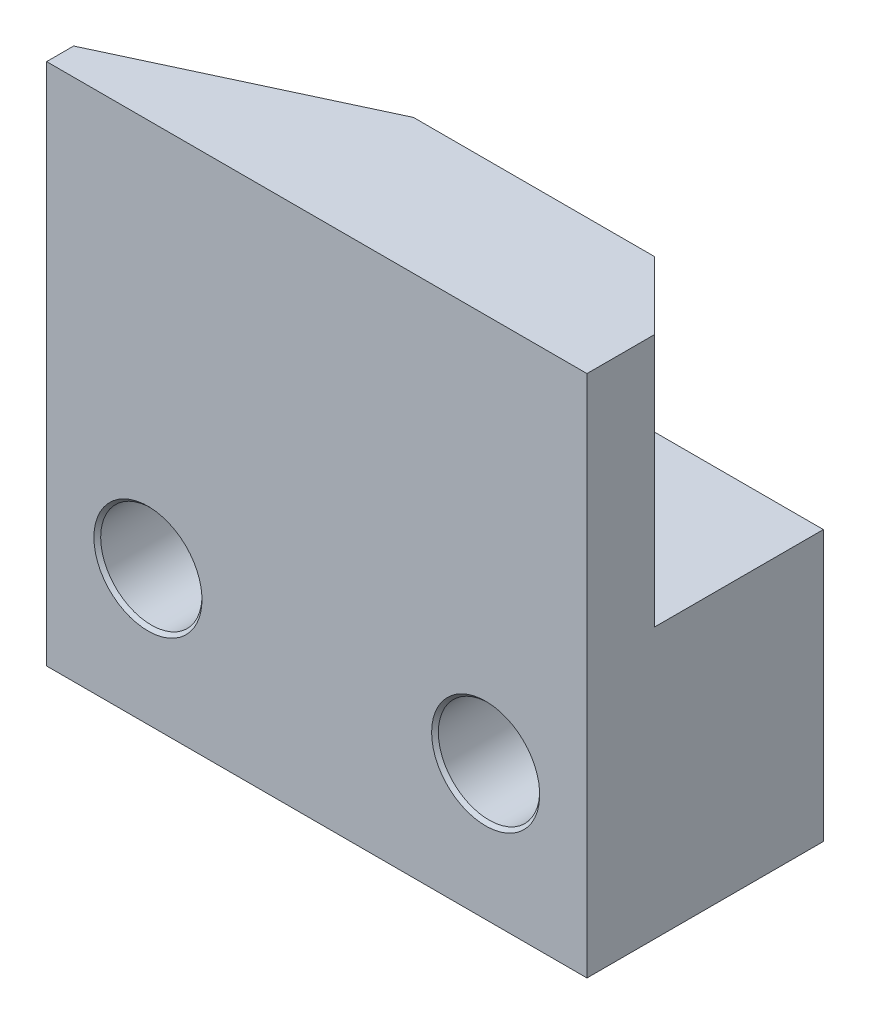
ISO-10303-21;
HEADER;
FILE_DESCRIPTION(('STEP AP214'),'2;1');
FILE_NAME('part.step','',(''),(''),'','','');
FILE_SCHEMA(('AUTOMOTIVE_DESIGN { 1 0 10303 214 1 1 1 1 }'));
ENDSEC;
DATA;
#1=APPLICATION_CONTEXT('core data for automotive mechanical design processes');
#2=APPLICATION_PROTOCOL_DEFINITION('international standard','automotive_design',2000,#1);
#3=PRODUCT_CONTEXT('',#1,'mechanical');
#4=PRODUCT('Part','Part','',(#3));
#5=PRODUCT_RELATED_PRODUCT_CATEGORY('part','',(#4));
#6=PRODUCT_DEFINITION_FORMATION('','',#4);
#7=PRODUCT_DEFINITION_CONTEXT('part definition',#1,'design');
#8=PRODUCT_DEFINITION('design','',#6,#7);
#9=PRODUCT_DEFINITION_SHAPE('','',#8);
#10=(LENGTH_UNIT() NAMED_UNIT(*) SI_UNIT(.MILLI.,.METRE.));
#11=(NAMED_UNIT(*) PLANE_ANGLE_UNIT() SI_UNIT($,.RADIAN.));
#12=(NAMED_UNIT(*) SI_UNIT($,.STERADIAN.) SOLID_ANGLE_UNIT());
#13=UNCERTAINTY_MEASURE_WITH_UNIT(LENGTH_MEASURE(1.E-05),#10,'distance_accuracy_value','');
#14=(GEOMETRIC_REPRESENTATION_CONTEXT(3) GLOBAL_UNCERTAINTY_ASSIGNED_CONTEXT((#13)) GLOBAL_UNIT_ASSIGNED_CONTEXT((#10,
#11,#12)) REPRESENTATION_CONTEXT('',''));
#15=CARTESIAN_POINT('',(0.,0.,0.));
#16=DIRECTION('',(0.,0.,1.));
#17=DIRECTION('',(1.,0.,0.));
#18=AXIS2_PLACEMENT_3D('',#15,#16,#17);
#19=CARTESIAN_POINT('',(16.,15.5,-7.));
#20=DIRECTION('',(0.,0.,1.));
#21=DIRECTION('',(1.,0.,0.));
#22=AXIS2_PLACEMENT_3D('',#19,#20,#21);
#23=PLANE('',#22);
#24=CARTESIAN_POINT('',(3.,4.,-7.));
#25=DIRECTION('',(0.,0.,-1.));
#26=DIRECTION('',(-1.,0.,0.));
#27=AXIS2_PLACEMENT_3D('',#24,#25,#26);
#28=CIRCLE('',#27,1.6);
#29=CARTESIAN_POINT('',(1.4,4.,-7.));
#30=VERTEX_POINT('',#29);
#31=EDGE_CURVE('E173',#30,#30,#28,.T.);
#32=ORIENTED_EDGE('',*,*,#31,.F.);
#33=EDGE_LOOP('',(#32));
#34=FACE_BOUND('',#33,.T.);
#35=CARTESIAN_POINT('',(13.,4.,-7.));
#36=DIRECTION('',(0.,0.,-1.));
#37=DIRECTION('',(-1.,0.,0.));
#38=AXIS2_PLACEMENT_3D('',#35,#36,#37);
#39=CIRCLE('',#38,1.6);
#40=CARTESIAN_POINT('',(11.4,4.,-7.));
#41=VERTEX_POINT('',#40);
#42=EDGE_CURVE('E161',#41,#41,#39,.T.);
#43=ORIENTED_EDGE('',*,*,#42,.F.);
#44=EDGE_LOOP('',(#43));
#45=FACE_BOUND('',#44,.T.);
#46=DIRECTION('',(1.,0.,0.));
#47=VECTOR('',#46,1.);
#48=CARTESIAN_POINT('',(-5.72541929498862,8.,-7.));
#49=LINE('',#48,#47);
#50=CARTESIAN_POINT('',(0.,8.,-7.));
#51=VERTEX_POINT('',#50);
#52=CARTESIAN_POINT('',(16.,8.,-7.));
#53=VERTEX_POINT('',#52);
#54=EDGE_CURVE('E153',#51,#53,#49,.T.);
#55=ORIENTED_EDGE('',*,*,#54,.T.);
#56=DIRECTION('',(0.,-1.,0.));
#57=VECTOR('',#56,1.);
#58=CARTESIAN_POINT('',(16.,15.5,-7.));
#59=LINE('',#58,#57);
#60=CARTESIAN_POINT('',(16.,0.,-7.));
#61=VERTEX_POINT('',#60);
#62=EDGE_CURVE('E89',#53,#61,#59,.T.);
#63=ORIENTED_EDGE('',*,*,#62,.T.);
#64=DIRECTION('',(-1.,0.,0.));
#65=VECTOR('',#64,1.);
#66=CARTESIAN_POINT('',(16.,0.,-7.));
#67=LINE('',#66,#65);
#68=CARTESIAN_POINT('',(0.,0.,-7.));
#69=VERTEX_POINT('',#68);
#70=EDGE_CURVE('E93',#61,#69,#67,.T.);
#71=ORIENTED_EDGE('',*,*,#70,.T.);
#72=DIRECTION('',(0.,-1.,0.));
#73=VECTOR('',#72,1.);
#74=CARTESIAN_POINT('',(0.,15.5,-7.));
#75=LINE('',#74,#73);
#76=EDGE_CURVE('E77',#51,#69,#75,.T.);
#77=ORIENTED_EDGE('',*,*,#76,.F.);
#78=EDGE_LOOP('',(#55,#63,#71,#77));
#79=FACE_BOUND('',#78,.T.);
#80=ADVANCED_FACE('F33',(#34,#45,#79),#23,.F.);
#81=CARTESIAN_POINT('',(0.,15.5,-7.));
#82=DIRECTION('',(1.,0.,0.));
#83=DIRECTION('',(0.,0.,-1.));
#84=AXIS2_PLACEMENT_3D('',#81,#82,#83);
#85=PLANE('',#84);
#86=DIRECTION('',(0.,0.,1.));
#87=VECTOR('',#86,1.);
#88=CARTESIAN_POINT('',(0.,15.5,-7.));
#89=LINE('',#88,#87);
#90=CARTESIAN_POINT('',(0.,15.5,-0.8));
#91=VERTEX_POINT('',#90);
#92=CARTESIAN_POINT('',(0.,15.5,0.));
#93=VERTEX_POINT('',#92);
#94=EDGE_CURVE('E98',#91,#93,#89,.T.);
#95=ORIENTED_EDGE('',*,*,#94,.F.);
#96=DIRECTION('',(0.,1.,0.));
#97=VECTOR('',#96,1.);
#98=CARTESIAN_POINT('',(0.,-17.1592540630413,-0.8));
#99=LINE('',#98,#97);
#100=CARTESIAN_POINT('',(0.,8.,-0.8));
#101=VERTEX_POINT('',#100);
#102=EDGE_CURVE('E124',#101,#91,#99,.T.);
#103=ORIENTED_EDGE('',*,*,#102,.F.);
#104=DIRECTION('',(0.,0.,-1.));
#105=VECTOR('',#104,1.);
#106=CARTESIAN_POINT('',(0.,8.,-3.5));
#107=LINE('',#106,#105);
#108=EDGE_CURVE('E86',#101,#51,#107,.T.);
#109=ORIENTED_EDGE('',*,*,#108,.T.);
#110=ORIENTED_EDGE('',*,*,#76,.T.);
#111=DIRECTION('',(0.,0.,1.));
#112=VECTOR('',#111,1.);
#113=CARTESIAN_POINT('',(0.,0.,-7.));
#114=LINE('',#113,#112);
#115=CARTESIAN_POINT('',(0.,0.,0.));
#116=VERTEX_POINT('',#115);
#117=EDGE_CURVE('E82',#69,#116,#114,.T.);
#118=ORIENTED_EDGE('',*,*,#117,.T.);
#119=DIRECTION('',(0.,-1.,0.));
#120=VECTOR('',#119,1.);
#121=CARTESIAN_POINT('',(0.,15.5,0.));
#122=LINE('',#121,#120);
#123=EDGE_CURVE('E12',#93,#116,#122,.T.);
#124=ORIENTED_EDGE('',*,*,#123,.F.);
#125=EDGE_LOOP('',(#95,#103,#109,#110,#118,#124));
#126=FACE_BOUND('',#125,.T.);
#127=ADVANCED_FACE('F35',(#126),#85,.F.);
#128=CARTESIAN_POINT('',(0.,15.5,0.));
#129=DIRECTION('',(0.,0.,-1.));
#130=DIRECTION('',(-1.,0.,0.));
#131=AXIS2_PLACEMENT_3D('',#128,#129,#130);
#132=PLANE('',#131);
#133=CARTESIAN_POINT('',(3.,4.,0.));
#134=DIRECTION('',(0.,0.,-1.));
#135=DIRECTION('',(-1.,0.,0.));
#136=AXIS2_PLACEMENT_3D('',#133,#134,#135);
#137=CIRCLE('',#136,1.6);
#138=CARTESIAN_POINT('',(1.4,4.,0.));
#139=VERTEX_POINT('',#138);
#140=EDGE_CURVE('E176',#139,#139,#137,.T.);
#141=ORIENTED_EDGE('',*,*,#140,.T.);
#142=EDGE_LOOP('',(#141));
#143=FACE_BOUND('',#142,.T.);
#144=CARTESIAN_POINT('',(13.,4.,0.));
#145=DIRECTION('',(0.,0.,-1.));
#146=DIRECTION('',(-1.,0.,0.));
#147=AXIS2_PLACEMENT_3D('',#144,#145,#146);
#148=CIRCLE('',#147,1.6);
#149=CARTESIAN_POINT('',(11.4,4.,0.));
#150=VERTEX_POINT('',#149);
#151=EDGE_CURVE('E164',#150,#150,#148,.T.);
#152=ORIENTED_EDGE('',*,*,#151,.T.);
#153=EDGE_LOOP('',(#152));
#154=FACE_BOUND('',#153,.T.);
#155=DIRECTION('',(1.,0.,0.));
#156=VECTOR('',#155,1.);
#157=CARTESIAN_POINT('',(0.,0.,0.));
#158=LINE('',#157,#156);
#159=CARTESIAN_POINT('',(16.,0.,0.));
#160=VERTEX_POINT('',#159);
#161=EDGE_CURVE('E102',#116,#160,#158,.T.);
#162=ORIENTED_EDGE('',*,*,#161,.T.);
#163=DIRECTION('',(0.,-1.,0.));
#164=VECTOR('',#163,1.);
#165=CARTESIAN_POINT('',(16.,15.5,0.));
#166=LINE('',#165,#164);
#167=CARTESIAN_POINT('',(16.,15.5,0.));
#168=VERTEX_POINT('',#167);
#169=EDGE_CURVE('E41',#168,#160,#166,.T.);
#170=ORIENTED_EDGE('',*,*,#169,.F.);
#171=DIRECTION('',(1.,0.,0.));
#172=VECTOR('',#171,1.);
#173=CARTESIAN_POINT('',(0.,15.5,0.));
#174=LINE('',#173,#172);
#175=EDGE_CURVE('E57',#93,#168,#174,.T.);
#176=ORIENTED_EDGE('',*,*,#175,.F.);
#177=ORIENTED_EDGE('',*,*,#123,.T.);
#178=EDGE_LOOP('',(#162,#170,#176,#177));
#179=FACE_BOUND('',#178,.T.);
#180=ADVANCED_FACE('F120',(#143,#154,#179),#132,.F.);
#181=CARTESIAN_POINT('',(16.,15.5,0.));
#182=DIRECTION('',(-1.,0.,0.));
#183=DIRECTION('',(0.,0.,1.));
#184=AXIS2_PLACEMENT_3D('',#181,#182,#183);
#185=PLANE('',#184);
#186=DIRECTION('',(0.,0.,1.));
#187=VECTOR('',#186,1.);
#188=CARTESIAN_POINT('',(16.,8.,-3.5));
#189=LINE('',#188,#187);
#190=CARTESIAN_POINT('',(16.,8.,-2.));
#191=VERTEX_POINT('',#190);
#192=EDGE_CURVE('E139',#53,#191,#189,.T.);
#193=ORIENTED_EDGE('',*,*,#192,.T.);
#194=DIRECTION('',(0.,1.,0.));
#195=VECTOR('',#194,1.);
#196=CARTESIAN_POINT('',(16.,-17.1592540630413,-2.));
#197=LINE('',#196,#195);
#198=CARTESIAN_POINT('',(16.,15.5,-2.));
#199=VERTEX_POINT('',#198);
#200=EDGE_CURVE('E133',#191,#199,#197,.T.);
#201=ORIENTED_EDGE('',*,*,#200,.T.);
#202=DIRECTION('',(0.,0.,-1.));
#203=VECTOR('',#202,1.);
#204=CARTESIAN_POINT('',(16.,15.5,0.));
#205=LINE('',#204,#203);
#206=EDGE_CURVE('E90',#168,#199,#205,.T.);
#207=ORIENTED_EDGE('',*,*,#206,.F.);
#208=ORIENTED_EDGE('',*,*,#169,.T.);
#209=DIRECTION('',(0.,0.,-1.));
#210=VECTOR('',#209,1.);
#211=CARTESIAN_POINT('',(16.,0.,0.));
#212=LINE('',#211,#210);
#213=EDGE_CURVE('E99',#160,#61,#212,.T.);
#214=ORIENTED_EDGE('',*,*,#213,.T.);
#215=ORIENTED_EDGE('',*,*,#62,.F.);
#216=EDGE_LOOP('',(#193,#201,#207,#208,#214,#215));
#217=FACE_BOUND('',#216,.T.);
#218=ADVANCED_FACE('F117',(#217),#185,.F.);
#219=CARTESIAN_POINT('',(0.,15.5,0.));
#220=DIRECTION('',(0.,1.,0.));
#221=DIRECTION('',(0.,0.,1.));
#222=AXIS2_PLACEMENT_3D('',#219,#220,#221);
#223=PLANE('',#222);
#224=DIRECTION('',(0.906307787036652,0.,-0.422618261740694));
#225=VECTOR('',#224,1.);
#226=CARTESIAN_POINT('',(-3.66866394082319,15.5,0.910726090802925));
#227=LINE('',#226,#225);
#228=CARTESIAN_POINT('',(6.86242214563069,15.5,-4.));
#229=VERTEX_POINT('',#228);
#230=EDGE_CURVE('E134',#91,#229,#227,.T.);
#231=ORIENTED_EDGE('',*,*,#230,.F.);
#232=ORIENTED_EDGE('',*,*,#94,.T.);
#233=ORIENTED_EDGE('',*,*,#175,.T.);
#234=ORIENTED_EDGE('',*,*,#206,.T.);
#235=DIRECTION('',(0.707106781186551,0.,0.707106781186544));
#236=VECTOR('',#235,1.);
#237=CARTESIAN_POINT('',(4.38729035250558,15.5,-13.6127096474943));
#238=LINE('',#237,#236);
#239=CARTESIAN_POINT('',(14.,15.5,-4.));
#240=VERTEX_POINT('',#239);
#241=EDGE_CURVE('E142',#240,#199,#238,.T.);
#242=ORIENTED_EDGE('',*,*,#241,.F.);
#243=DIRECTION('',(1.,0.,0.));
#244=VECTOR('',#243,1.);
#245=CARTESIAN_POINT('',(-5.72541929498862,15.5,-4.));
#246=LINE('',#245,#244);
#247=EDGE_CURVE('E48',#229,#240,#246,.T.);
#248=ORIENTED_EDGE('',*,*,#247,.F.);
#249=EDGE_LOOP('',(#231,#232,#233,#234,#242,#248));
#250=FACE_BOUND('',#249,.T.);
#251=ADVANCED_FACE('F236',(#250),#223,.T.);
#252=CARTESIAN_POINT('',(0.,0.,0.));
#253=DIRECTION('',(0.,1.,0.));
#254=DIRECTION('',(0.,0.,1.));
#255=AXIS2_PLACEMENT_3D('',#252,#253,#254);
#256=PLANE('',#255);
#257=ORIENTED_EDGE('',*,*,#117,.F.);
#258=ORIENTED_EDGE('',*,*,#70,.F.);
#259=ORIENTED_EDGE('',*,*,#213,.F.);
#260=ORIENTED_EDGE('',*,*,#161,.F.);
#261=EDGE_LOOP('',(#257,#258,#259,#260));
#262=FACE_BOUND('',#261,.T.);
#263=ADVANCED_FACE('F101',(#262),#256,.F.);
#264=CARTESIAN_POINT('',(-5.72541929498862,-17.1592540630413,-4.));
#265=DIRECTION('',(0.,0.,1.));
#266=DIRECTION('',(1.,0.,0.));
#267=AXIS2_PLACEMENT_3D('',#264,#265,#266);
#268=PLANE('',#267);
#269=DIRECTION('',(-1.,0.,0.));
#270=VECTOR('',#269,1.);
#271=CARTESIAN_POINT('',(-5.72541929498862,8.,-4.));
#272=LINE('',#271,#270);
#273=CARTESIAN_POINT('',(14.,8.,-4.));
#274=VERTEX_POINT('',#273);
#275=CARTESIAN_POINT('',(6.86242214563069,8.,-4.));
#276=VERTEX_POINT('',#275);
#277=EDGE_CURVE('E107',#274,#276,#272,.T.);
#278=ORIENTED_EDGE('',*,*,#277,.T.);
#279=DIRECTION('',(0.,1.,0.));
#280=VECTOR('',#279,1.);
#281=CARTESIAN_POINT('',(6.86242214563069,-17.1592540630413,-4.));
#282=LINE('',#281,#280);
#283=EDGE_CURVE('E137',#276,#229,#282,.T.);
#284=ORIENTED_EDGE('',*,*,#283,.T.);
#285=ORIENTED_EDGE('',*,*,#247,.T.);
#286=DIRECTION('',(0.,1.,0.));
#287=VECTOR('',#286,1.);
#288=CARTESIAN_POINT('',(14.,-17.1592540630413,-4.));
#289=LINE('',#288,#287);
#290=EDGE_CURVE('E131',#274,#240,#289,.T.);
#291=ORIENTED_EDGE('',*,*,#290,.F.);
#292=EDGE_LOOP('',(#278,#284,#285,#291));
#293=FACE_BOUND('',#292,.T.);
#294=ADVANCED_FACE('F229',(#293),#268,.F.);
#295=CARTESIAN_POINT('',(-3.66866394082319,-17.1592540630413,0.910726090802925));
#296=DIRECTION('',(0.422618261740694,0.,0.906307787036652));
#297=DIRECTION('',(0.906307787036652,0.,-0.422618261740694));
#298=AXIS2_PLACEMENT_3D('',#295,#296,#297);
#299=PLANE('',#298);
#300=DIRECTION('',(-0.906307787036652,0.,0.422618261740694));
#301=VECTOR('',#300,1.);
#302=CARTESIAN_POINT('',(-3.66866394082319,8.,0.910726090802925));
#303=LINE('',#302,#301);
#304=EDGE_CURVE('E149',#276,#101,#303,.T.);
#305=ORIENTED_EDGE('',*,*,#304,.T.);
#306=ORIENTED_EDGE('',*,*,#102,.T.);
#307=ORIENTED_EDGE('',*,*,#230,.T.);
#308=ORIENTED_EDGE('',*,*,#283,.F.);
#309=EDGE_LOOP('',(#305,#306,#307,#308));
#310=FACE_BOUND('',#309,.T.);
#311=ADVANCED_FACE('F226',(#310),#299,.F.);
#312=CARTESIAN_POINT('',(4.38729035250558,-17.1592540630413,-13.6127096474943));
#313=DIRECTION('',(-0.707106781186544,0.,0.707106781186551));
#314=DIRECTION('',(0.707106781186551,0.,0.707106781186544));
#315=AXIS2_PLACEMENT_3D('',#312,#313,#314);
#316=PLANE('',#315);
#317=DIRECTION('',(-0.707106781186551,0.,-0.707106781186544));
#318=VECTOR('',#317,1.);
#319=CARTESIAN_POINT('',(4.38729035250558,8.,-13.6127096474943));
#320=LINE('',#319,#318);
#321=EDGE_CURVE('E103',#191,#274,#320,.T.);
#322=ORIENTED_EDGE('',*,*,#321,.T.);
#323=ORIENTED_EDGE('',*,*,#290,.T.);
#324=ORIENTED_EDGE('',*,*,#241,.T.);
#325=ORIENTED_EDGE('',*,*,#200,.F.);
#326=EDGE_LOOP('',(#322,#323,#324,#325));
#327=FACE_BOUND('',#326,.T.);
#328=ADVANCED_FACE('F224',(#327),#316,.F.);
#329=CARTESIAN_POINT('',(0.,8.,0.));
#330=DIRECTION('',(0.,1.,0.));
#331=DIRECTION('',(0.,0.,1.));
#332=AXIS2_PLACEMENT_3D('',#329,#330,#331);
#333=PLANE('',#332);
#334=ORIENTED_EDGE('',*,*,#277,.F.);
#335=ORIENTED_EDGE('',*,*,#321,.F.);
#336=ORIENTED_EDGE('',*,*,#192,.F.);
#337=ORIENTED_EDGE('',*,*,#54,.F.);
#338=ORIENTED_EDGE('',*,*,#108,.F.);
#339=ORIENTED_EDGE('',*,*,#304,.F.);
#340=EDGE_LOOP('',(#334,#335,#336,#337,#338,#339));
#341=FACE_BOUND('',#340,.T.);
#342=ADVANCED_FACE('F220',(#341),#333,.T.);
#343=CARTESIAN_POINT('',(13.,4.,-0.100000000000001));
#344=DIRECTION('',(0.,0.,1.));
#345=DIRECTION('',(1.,0.,0.));
#346=AXIS2_PLACEMENT_3D('',#343,#344,#345);
#347=CONICAL_SURFACE('',#346,1.5,0.785398163397448);
#348=ORIENTED_EDGE('',*,*,#151,.F.);
#349=EDGE_LOOP('',(#348));
#350=FACE_BOUND('',#349,.T.);
#351=CARTESIAN_POINT('',(13.,4.,-0.100000000000001));
#352=DIRECTION('',(0.,0.,-1.));
#353=DIRECTION('',(-1.,0.,0.));
#354=AXIS2_PLACEMENT_3D('',#351,#352,#353);
#355=CIRCLE('',#354,1.5);
#356=CARTESIAN_POINT('',(11.5,4.,-0.100000000000001));
#357=VERTEX_POINT('',#356);
#358=EDGE_CURVE('E146',#357,#357,#355,.T.);
#359=ORIENTED_EDGE('',*,*,#358,.T.);
#360=EDGE_LOOP('',(#359));
#361=FACE_BOUND('',#360,.T.);
#362=ADVANCED_FACE('F213',(#350,#361),#347,.F.);
#363=CARTESIAN_POINT('',(13.,4.,-7.));
#364=DIRECTION('',(0.,0.,-1.));
#365=DIRECTION('',(-1.,0.,0.));
#366=AXIS2_PLACEMENT_3D('',#363,#364,#365);
#367=CYLINDRICAL_SURFACE('',#366,1.5);
#368=ORIENTED_EDGE('',*,*,#358,.F.);
#369=EDGE_LOOP('',(#368));
#370=FACE_BOUND('',#369,.T.);
#371=CARTESIAN_POINT('',(13.,4.,-6.9));
#372=DIRECTION('',(0.,0.,-1.));
#373=DIRECTION('',(-1.,0.,0.));
#374=AXIS2_PLACEMENT_3D('',#371,#372,#373);
#375=CIRCLE('',#374,1.5);
#376=CARTESIAN_POINT('',(11.5,4.,-6.9));
#377=VERTEX_POINT('',#376);
#378=EDGE_CURVE('E158',#377,#377,#375,.T.);
#379=ORIENTED_EDGE('',*,*,#378,.T.);
#380=EDGE_LOOP('',(#379));
#381=FACE_BOUND('',#380,.T.);
#382=ADVANCED_FACE('F207',(#370,#381),#367,.F.);
#383=CARTESIAN_POINT('',(13.,4.,-7.));
#384=DIRECTION('',(0.,0.,-1.));
#385=DIRECTION('',(-1.,0.,0.));
#386=AXIS2_PLACEMENT_3D('',#383,#384,#385);
#387=CONICAL_SURFACE('',#386,1.6,0.785398163397457);
#388=ORIENTED_EDGE('',*,*,#378,.F.);
#389=EDGE_LOOP('',(#388));
#390=FACE_BOUND('',#389,.T.);
#391=ORIENTED_EDGE('',*,*,#42,.T.);
#392=EDGE_LOOP('',(#391));
#393=FACE_BOUND('',#392,.T.);
#394=ADVANCED_FACE('F186',(#390,#393),#387,.F.);
#395=CARTESIAN_POINT('',(3.,4.,-0.1));
#396=DIRECTION('',(0.,0.,1.));
#397=DIRECTION('',(1.,0.,0.));
#398=AXIS2_PLACEMENT_3D('',#395,#396,#397);
#399=CONICAL_SURFACE('',#398,1.5,0.785398163397444);
#400=ORIENTED_EDGE('',*,*,#140,.F.);
#401=EDGE_LOOP('',(#400));
#402=FACE_BOUND('',#401,.T.);
#403=CARTESIAN_POINT('',(3.,4.,-0.1));
#404=DIRECTION('',(0.,0.,-1.));
#405=DIRECTION('',(-1.,0.,0.));
#406=AXIS2_PLACEMENT_3D('',#403,#404,#405);
#407=CIRCLE('',#406,1.5);
#408=CARTESIAN_POINT('',(1.5,4.,-0.1));
#409=VERTEX_POINT('',#408);
#410=EDGE_CURVE('E167',#409,#409,#407,.T.);
#411=ORIENTED_EDGE('',*,*,#410,.T.);
#412=EDGE_LOOP('',(#411));
#413=FACE_BOUND('',#412,.T.);
#414=ADVANCED_FACE('F182',(#402,#413),#399,.F.);
#415=CARTESIAN_POINT('',(3.,4.,-7.));
#416=DIRECTION('',(0.,0.,-1.));
#417=DIRECTION('',(-1.,0.,0.));
#418=AXIS2_PLACEMENT_3D('',#415,#416,#417);
#419=CYLINDRICAL_SURFACE('',#418,1.5);
#420=ORIENTED_EDGE('',*,*,#410,.F.);
#421=EDGE_LOOP('',(#420));
#422=FACE_BOUND('',#421,.T.);
#423=CARTESIAN_POINT('',(3.,4.,-6.9));
#424=DIRECTION('',(0.,0.,-1.));
#425=DIRECTION('',(-1.,0.,0.));
#426=AXIS2_PLACEMENT_3D('',#423,#424,#425);
#427=CIRCLE('',#426,1.5);
#428=CARTESIAN_POINT('',(1.5,4.,-6.9));
#429=VERTEX_POINT('',#428);
#430=EDGE_CURVE('E170',#429,#429,#427,.T.);
#431=ORIENTED_EDGE('',*,*,#430,.T.);
#432=EDGE_LOOP('',(#431));
#433=FACE_BOUND('',#432,.T.);
#434=ADVANCED_FACE('F185',(#422,#433),#419,.F.);
#435=CARTESIAN_POINT('',(3.,4.,-7.));
#436=DIRECTION('',(0.,0.,-1.));
#437=DIRECTION('',(-1.,0.,0.));
#438=AXIS2_PLACEMENT_3D('',#435,#436,#437);
#439=CONICAL_SURFACE('',#438,1.6,0.785398163397457);
#440=ORIENTED_EDGE('',*,*,#430,.F.);
#441=EDGE_LOOP('',(#440));
#442=FACE_BOUND('',#441,.T.);
#443=ORIENTED_EDGE('',*,*,#31,.T.);
#444=EDGE_LOOP('',(#443));
#445=FACE_BOUND('',#444,.T.);
#446=ADVANCED_FACE('F192',(#442,#445),#439,.F.);
#447=CLOSED_SHELL('',(#80,#127,#180,#218,#251,#263,#294,#311,#328,#342,#362,#382,#394,#414,#434,#446));
#448=MANIFOLD_SOLID_BREP('B2',#447);
#449=ADVANCED_BREP_SHAPE_REPRESENTATION('',(#18,#448),#14);
#450=SHAPE_DEFINITION_REPRESENTATION(#9,#449);
ENDSEC;
END-ISO-10303-21;
